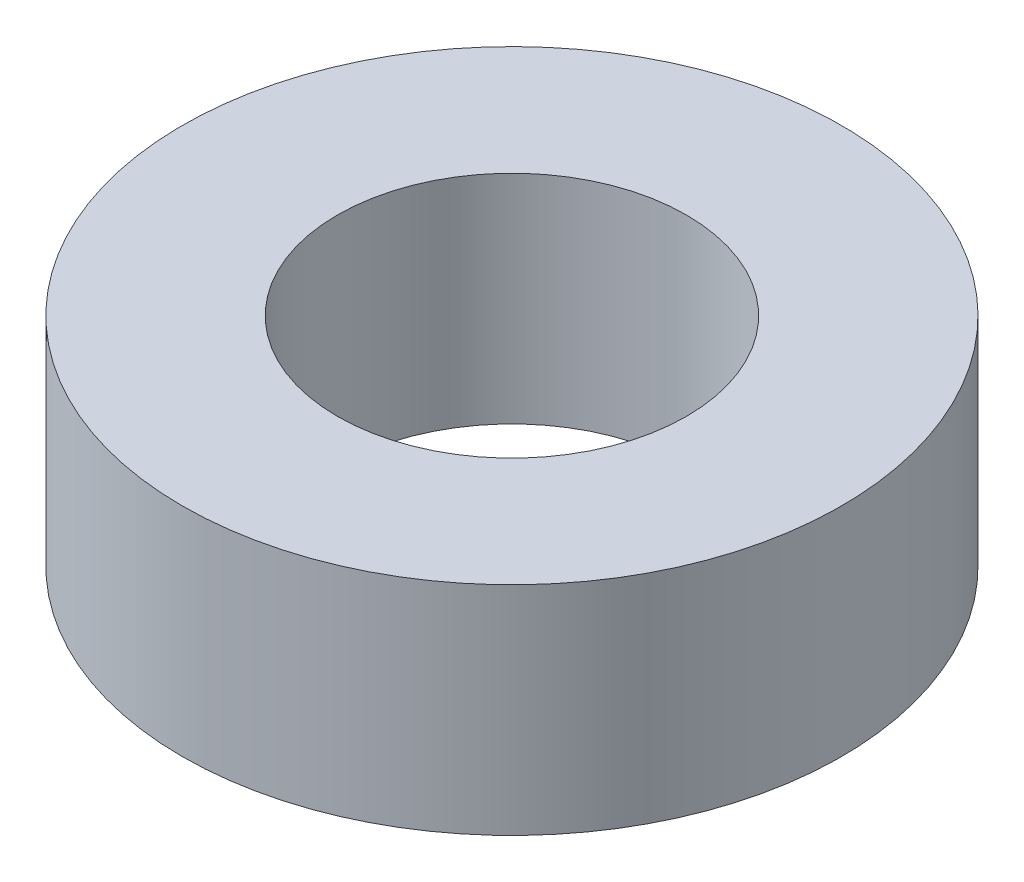
ISO-10303-21;
HEADER;
FILE_DESCRIPTION(('STEP AP214'),'2;1');
FILE_NAME('part.step','',(''),(''),'','','');
FILE_SCHEMA(('AUTOMOTIVE_DESIGN { 1 0 10303 214 1 1 1 1 }'));
ENDSEC;
DATA;
#1=APPLICATION_CONTEXT('core data for automotive mechanical design processes');
#2=APPLICATION_PROTOCOL_DEFINITION('international standard','automotive_design',2000,#1);
#3=PRODUCT_CONTEXT('',#1,'mechanical');
#4=PRODUCT('Part','Part','',(#3));
#5=PRODUCT_RELATED_PRODUCT_CATEGORY('part','',(#4));
#6=PRODUCT_DEFINITION_FORMATION('','',#4);
#7=PRODUCT_DEFINITION_CONTEXT('part definition',#1,'design');
#8=PRODUCT_DEFINITION('design','',#6,#7);
#9=PRODUCT_DEFINITION_SHAPE('','',#8);
#10=(LENGTH_UNIT() NAMED_UNIT(*) SI_UNIT(.MILLI.,.METRE.));
#11=(NAMED_UNIT(*) PLANE_ANGLE_UNIT() SI_UNIT($,.RADIAN.));
#12=(NAMED_UNIT(*) SI_UNIT($,.STERADIAN.) SOLID_ANGLE_UNIT());
#13=UNCERTAINTY_MEASURE_WITH_UNIT(LENGTH_MEASURE(1.E-05),#10,'distance_accuracy_value','');
#14=(GEOMETRIC_REPRESENTATION_CONTEXT(3) GLOBAL_UNCERTAINTY_ASSIGNED_CONTEXT((#13)) GLOBAL_UNIT_ASSIGNED_CONTEXT((#10,
#11,#12)) REPRESENTATION_CONTEXT('',''));
#15=CARTESIAN_POINT('',(0.,0.,0.));
#16=DIRECTION('',(0.,0.,1.));
#17=DIRECTION('',(1.,0.,0.));
#18=AXIS2_PLACEMENT_3D('',#15,#16,#17);
#19=CARTESIAN_POINT('',(0.,7.112,0.));
#20=DIRECTION('',(0.,1.,0.));
#21=DIRECTION('',(0.,0.,1.));
#22=AXIS2_PLACEMENT_3D('',#19,#20,#21);
#23=PLANE('',#22);
#24=CARTESIAN_POINT('',(0.,7.112,0.));
#25=DIRECTION('',(0.,1.,0.));
#26=DIRECTION('',(0.,0.,1.));
#27=AXIS2_PLACEMENT_3D('',#24,#25,#26);
#28=CIRCLE('',#27,10.795);
#29=CARTESIAN_POINT('',(0.,7.112,10.795));
#30=VERTEX_POINT('',#29);
#31=EDGE_CURVE('E10',#30,#30,#28,.T.);
#32=ORIENTED_EDGE('',*,*,#31,.T.);
#33=EDGE_LOOP('',(#32));
#34=FACE_BOUND('',#33,.T.);
#35=CARTESIAN_POINT('',(0.,7.112,0.));
#36=DIRECTION('',(0.,1.,0.));
#37=DIRECTION('',(0.,0.,1.));
#38=AXIS2_PLACEMENT_3D('',#35,#36,#37);
#39=CIRCLE('',#38,5.715);
#40=CARTESIAN_POINT('',(0.,7.112,5.715));
#41=VERTEX_POINT('',#40);
#42=EDGE_CURVE('E42',#41,#41,#39,.T.);
#43=ORIENTED_EDGE('',*,*,#42,.F.);
#44=EDGE_LOOP('',(#43));
#45=FACE_BOUND('',#44,.T.);
#46=ADVANCED_FACE('F31',(#34,#45),#23,.T.);
#47=CARTESIAN_POINT('',(0.,0.,0.));
#48=DIRECTION('',(0.,1.,0.));
#49=DIRECTION('',(0.,0.,1.));
#50=AXIS2_PLACEMENT_3D('',#47,#48,#49);
#51=PLANE('',#50);
#52=CARTESIAN_POINT('',(0.,0.,0.));
#53=DIRECTION('',(0.,1.,0.));
#54=DIRECTION('',(0.,0.,1.));
#55=AXIS2_PLACEMENT_3D('',#52,#53,#54);
#56=CIRCLE('',#55,10.795);
#57=CARTESIAN_POINT('',(0.,0.,10.795));
#58=VERTEX_POINT('',#57);
#59=EDGE_CURVE('E35',#58,#58,#56,.T.);
#60=ORIENTED_EDGE('',*,*,#59,.F.);
#61=EDGE_LOOP('',(#60));
#62=FACE_BOUND('',#61,.T.);
#63=CARTESIAN_POINT('',(0.,0.,0.));
#64=DIRECTION('',(0.,1.,0.));
#65=DIRECTION('',(0.,0.,1.));
#66=AXIS2_PLACEMENT_3D('',#63,#64,#65);
#67=CIRCLE('',#66,5.715);
#68=CARTESIAN_POINT('',(0.,0.,5.715));
#69=VERTEX_POINT('',#68);
#70=EDGE_CURVE('E44',#69,#69,#67,.T.);
#71=ORIENTED_EDGE('',*,*,#70,.T.);
#72=EDGE_LOOP('',(#71));
#73=FACE_BOUND('',#72,.T.);
#74=ADVANCED_FACE('F54',(#62,#73),#51,.F.);
#75=CARTESIAN_POINT('',(0.,7.112,0.));
#76=DIRECTION('',(0.,-1.,0.));
#77=DIRECTION('',(0.,0.,-1.));
#78=AXIS2_PLACEMENT_3D('',#75,#76,#77);
#79=CYLINDRICAL_SURFACE('',#78,10.795);
#80=ORIENTED_EDGE('',*,*,#31,.F.);
#81=EDGE_LOOP('',(#80));
#82=FACE_BOUND('',#81,.T.);
#83=ORIENTED_EDGE('',*,*,#59,.T.);
#84=EDGE_LOOP('',(#83));
#85=FACE_BOUND('',#84,.T.);
#86=ADVANCED_FACE('F33',(#82,#85),#79,.T.);
#87=CARTESIAN_POINT('',(0.,7.112,0.));
#88=DIRECTION('',(0.,-1.,0.));
#89=DIRECTION('',(0.,0.,-1.));
#90=AXIS2_PLACEMENT_3D('',#87,#88,#89);
#91=CYLINDRICAL_SURFACE('',#90,5.715);
#92=ORIENTED_EDGE('',*,*,#42,.T.);
#93=EDGE_LOOP('',(#92));
#94=FACE_BOUND('',#93,.T.);
#95=ORIENTED_EDGE('',*,*,#70,.F.);
#96=EDGE_LOOP('',(#95));
#97=FACE_BOUND('',#96,.T.);
#98=ADVANCED_FACE('F50',(#94,#97),#91,.F.);
#99=CLOSED_SHELL('',(#46,#74,#86,#98));
#100=MANIFOLD_SOLID_BREP('B2',#99);
#101=ADVANCED_BREP_SHAPE_REPRESENTATION('',(#18,#100),#14);
#102=SHAPE_DEFINITION_REPRESENTATION(#9,#101);
ENDSEC;
END-ISO-10303-21;
